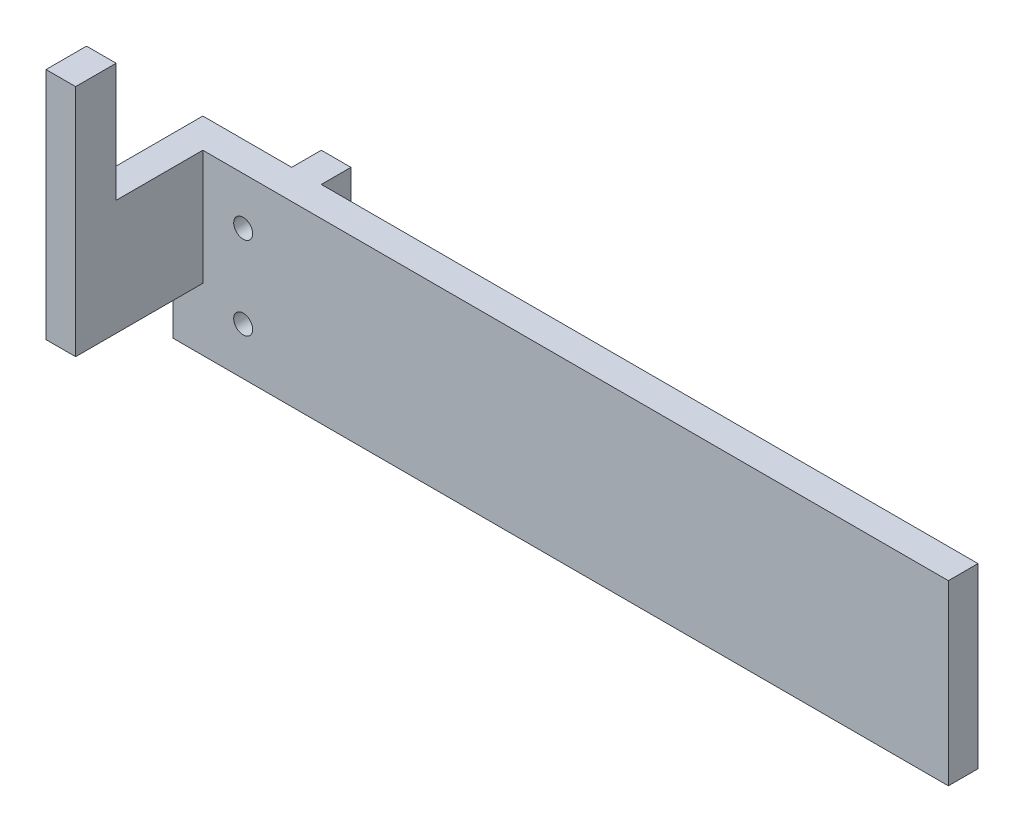
ISO-10303-21;
HEADER;
FILE_DESCRIPTION(('STEP AP214'),'2;1');
FILE_NAME('part.step','',(''),(''),'','','');
FILE_SCHEMA(('AUTOMOTIVE_DESIGN { 1 0 10303 214 1 1 1 1 }'));
ENDSEC;
DATA;
#1=APPLICATION_CONTEXT('core data for automotive mechanical design processes');
#2=APPLICATION_PROTOCOL_DEFINITION('international standard','automotive_design',2000,#1);
#3=PRODUCT_CONTEXT('',#1,'mechanical');
#4=PRODUCT('Part','Part','',(#3));
#5=PRODUCT_RELATED_PRODUCT_CATEGORY('part','',(#4));
#6=PRODUCT_DEFINITION_FORMATION('','',#4);
#7=PRODUCT_DEFINITION_CONTEXT('part definition',#1,'design');
#8=PRODUCT_DEFINITION('design','',#6,#7);
#9=PRODUCT_DEFINITION_SHAPE('','',#8);
#10=(LENGTH_UNIT() NAMED_UNIT(*) SI_UNIT(.MILLI.,.METRE.));
#11=(NAMED_UNIT(*) PLANE_ANGLE_UNIT() SI_UNIT($,.RADIAN.));
#12=(NAMED_UNIT(*) SI_UNIT($,.STERADIAN.) SOLID_ANGLE_UNIT());
#13=UNCERTAINTY_MEASURE_WITH_UNIT(LENGTH_MEASURE(1.E-05),#10,'distance_accuracy_value','');
#14=(GEOMETRIC_REPRESENTATION_CONTEXT(3) GLOBAL_UNCERTAINTY_ASSIGNED_CONTEXT((#13)) GLOBAL_UNIT_ASSIGNED_CONTEXT((#10,
#11,#12)) REPRESENTATION_CONTEXT('',''));
#15=CARTESIAN_POINT('',(0.,0.,0.));
#16=DIRECTION('',(0.,0.,1.));
#17=DIRECTION('',(1.,0.,0.));
#18=AXIS2_PLACEMENT_3D('',#15,#16,#17);
#19=CARTESIAN_POINT('',(10.,-30.,5.));
#20=DIRECTION('',(0.,1.,0.));
#21=DIRECTION('',(-1.,0.,0.));
#22=AXIS2_PLACEMENT_3D('',#19,#20,#21);
#23=PLANE('',#22);
#24=DIRECTION('',(1.,0.,0.));
#25=VECTOR('',#24,1.);
#26=CARTESIAN_POINT('',(10.,-30.,5.));
#27=LINE('',#26,#25);
#28=CARTESIAN_POINT('',(-4.99999999999997,-30.0000000000004,5.));
#29=VERTEX_POINT('',#28);
#30=CARTESIAN_POINT('',(125.849702387772,-29.9999999999999,5.0000000000001));
#31=VERTEX_POINT('',#30);
#32=EDGE_CURVE('E11',#29,#31,#27,.T.);
#33=ORIENTED_EDGE('',*,*,#32,.F.);
#34=DIRECTION('',(0.,0.,-1.));
#35=VECTOR('',#34,1.);
#36=CARTESIAN_POINT('',(-4.99999999999994,-30.,56.8867286142334));
#37=LINE('',#36,#35);
#38=CARTESIAN_POINT('',(-5.,-30.,0.));
#39=VERTEX_POINT('',#38);
#40=EDGE_CURVE('E133',#29,#39,#37,.T.);
#41=ORIENTED_EDGE('',*,*,#40,.T.);
#42=DIRECTION('',(1.,0.,0.));
#43=VECTOR('',#42,1.);
#44=CARTESIAN_POINT('',(10.,-30.,0.));
#45=LINE('',#44,#43);
#46=CARTESIAN_POINT('',(10.,-30.,0.));
#47=VERTEX_POINT('',#46);
#48=EDGE_CURVE('E39',#39,#47,#45,.T.);
#49=ORIENTED_EDGE('',*,*,#48,.T.);
#50=DIRECTION('',(0.,0.,-1.));
#51=VECTOR('',#50,1.);
#52=CARTESIAN_POINT('',(10.,-30.,35.4138126514913));
#53=LINE('',#52,#51);
#54=CARTESIAN_POINT('',(10.,-30.,-5.));
#55=VERTEX_POINT('',#54);
#56=EDGE_CURVE('E189',#47,#55,#53,.T.);
#57=ORIENTED_EDGE('',*,*,#56,.T.);
#58=DIRECTION('',(1.,0.,0.));
#59=VECTOR('',#58,1.);
#60=CARTESIAN_POINT('',(10.,-30.,-5.));
#61=LINE('',#60,#59);
#62=CARTESIAN_POINT('',(15.,-30.,-5.));
#63=VERTEX_POINT('',#62);
#64=EDGE_CURVE('E179',#55,#63,#61,.T.);
#65=ORIENTED_EDGE('',*,*,#64,.T.);
#66=DIRECTION('',(0.,0.,-1.));
#67=VECTOR('',#66,1.);
#68=CARTESIAN_POINT('',(15.,-30.,35.4138126514913));
#69=LINE('',#68,#67);
#70=CARTESIAN_POINT('',(15.,-30.,1.66533453693773E-13));
#71=VERTEX_POINT('',#70);
#72=EDGE_CURVE('E191',#71,#63,#69,.T.);
#73=ORIENTED_EDGE('',*,*,#72,.F.);
#74=DIRECTION('',(1.,0.,0.));
#75=VECTOR('',#74,1.);
#76=CARTESIAN_POINT('',(-15.4138126514911,-30.,1.97196981360208E-13));
#77=LINE('',#76,#75);
#78=CARTESIAN_POINT('',(125.849702387772,-30.,0.));
#79=VERTEX_POINT('',#78);
#80=EDGE_CURVE('E174',#71,#79,#77,.T.);
#81=ORIENTED_EDGE('',*,*,#80,.T.);
#82=DIRECTION('',(0.,0.,-1.));
#83=VECTOR('',#82,1.);
#84=CARTESIAN_POINT('',(125.849702387772,-29.9999999999999,5.00000000000001));
#85=LINE('',#84,#83);
#86=EDGE_CURVE('E136',#31,#79,#85,.T.);
#87=ORIENTED_EDGE('',*,*,#86,.F.);
#88=EDGE_LOOP('',(#33,#41,#49,#57,#65,#73,#81,#87));
#89=FACE_BOUND('',#88,.T.);
#90=ADVANCED_FACE('F35',(#89),#23,.F.);
#91=CARTESIAN_POINT('',(0.,-30.,56.8867286142334));
#92=DIRECTION('',(1.,0.,0.));
#93=DIRECTION('',(0.,0.,-1.));
#94=AXIS2_PLACEMENT_3D('',#91,#92,#93);
#95=PLANE('',#94);
#96=DIRECTION('',(0.,-1.,0.));
#97=VECTOR('',#96,1.);
#98=CARTESIAN_POINT('',(0.,-30.0000000000003,26.4729159627424));
#99=LINE('',#98,#97);
#100=CARTESIAN_POINT('',(0.,20.0348101575419,26.4729159627421));
#101=VERTEX_POINT('',#100);
#102=CARTESIAN_POINT('',(0.,-19.45597939679,26.4729159627424));
#103=VERTEX_POINT('',#102);
#104=EDGE_CURVE('E152',#101,#103,#99,.T.);
#105=ORIENTED_EDGE('',*,*,#104,.T.);
#106=DIRECTION('',(0.,0.,1.));
#107=VECTOR('',#106,1.);
#108=CARTESIAN_POINT('',(0.,-19.45597939679,26.4729159627424));
#109=LINE('',#108,#107);
#110=CARTESIAN_POINT('',(0.,-19.45597939679,5.));
#111=VERTEX_POINT('',#110);
#112=EDGE_CURVE('E410',#111,#103,#109,.T.);
#113=ORIENTED_EDGE('',*,*,#112,.F.);
#114=DIRECTION('',(0.,-1.,0.));
#115=VECTOR('',#114,1.);
#116=CARTESIAN_POINT('',(0.,0.,5.));
#117=LINE('',#116,#115);
#118=CARTESIAN_POINT('',(0.,0.,5.00000000000001));
#119=VERTEX_POINT('',#118);
#120=EDGE_CURVE('E44',#119,#111,#117,.T.);
#121=ORIENTED_EDGE('',*,*,#120,.F.);
#122=DIRECTION('',(0.,0.,-1.));
#123=VECTOR('',#122,1.);
#124=CARTESIAN_POINT('',(0.,0.,56.8867286142334));
#125=LINE('',#124,#123);
#126=CARTESIAN_POINT('',(0.,0.,19.6342265327139));
#127=VERTEX_POINT('',#126);
#128=EDGE_CURVE('E157',#127,#119,#125,.T.);
#129=ORIENTED_EDGE('',*,*,#128,.F.);
#130=DIRECTION('',(0.,-1.,0.));
#131=VECTOR('',#130,1.);
#132=CARTESIAN_POINT('',(0.,28.50639047767,19.6342265327138));
#133=LINE('',#132,#131);
#134=CARTESIAN_POINT('',(0.,20.0348101575419,19.6342265327138));
#135=VERTEX_POINT('',#134);
#136=EDGE_CURVE('E429',#135,#127,#133,.T.);
#137=ORIENTED_EDGE('',*,*,#136,.F.);
#138=DIRECTION('',(0.,0.,1.));
#139=VECTOR('',#138,1.);
#140=CARTESIAN_POINT('',(0.,20.0348101575419,26.4729159627421));
#141=LINE('',#140,#139);
#142=EDGE_CURVE('E415',#135,#101,#141,.T.);
#143=ORIENTED_EDGE('',*,*,#142,.T.);
#144=EDGE_LOOP('',(#105,#113,#121,#129,#137,#143));
#145=FACE_BOUND('',#144,.T.);
#146=ADVANCED_FACE('F250',(#145),#95,.T.);
#147=CARTESIAN_POINT('',(7085.70409558259,-5534.5527787772,26.4729159628043));
#148=DIRECTION('',(0.,0.,1.));
#149=DIRECTION('',(-1.,-1.06410404851943E-12,0.));
#150=AXIS2_PLACEMENT_3D('',#147,#148,#149);
#151=PLANE('',#150);
#152=DIRECTION('',(0.,1.,0.));
#153=VECTOR('',#152,1.);
#154=CARTESIAN_POINT('',(-4.99999999999997,-30.0000000000003,26.4729159627424));
#155=LINE('',#154,#153);
#156=CARTESIAN_POINT('',(-4.99999999999997,-19.45597939679,26.4729159627423));
#157=VERTEX_POINT('',#156);
#158=CARTESIAN_POINT('',(-4.99999999999999,20.0348101575419,26.4729159627421));
#159=VERTEX_POINT('',#158);
#160=EDGE_CURVE('E435',#157,#159,#155,.T.);
#161=ORIENTED_EDGE('',*,*,#160,.F.);
#162=DIRECTION('',(-1.,0.,0.));
#163=VECTOR('',#162,1.);
#164=CARTESIAN_POINT('',(-5.,-19.45597939679,26.4729159627424));
#165=LINE('',#164,#163);
#166=EDGE_CURVE('E52',#103,#157,#165,.T.);
#167=ORIENTED_EDGE('',*,*,#166,.F.);
#168=ORIENTED_EDGE('',*,*,#104,.F.);
#169=DIRECTION('',(-1.,0.,0.));
#170=VECTOR('',#169,1.);
#171=CARTESIAN_POINT('',(-4.99999999999998,20.0348101575419,26.4729159627421));
#172=LINE('',#171,#170);
#173=EDGE_CURVE('E418',#101,#159,#172,.T.);
#174=ORIENTED_EDGE('',*,*,#173,.T.);
#175=EDGE_LOOP('',(#161,#167,#168,#174));
#176=FACE_BOUND('',#175,.T.);
#177=ADVANCED_FACE('F255',(#176),#151,.T.);
#178=CARTESIAN_POINT('',(-4.99999999999994,-30.,56.8867286142334));
#179=DIRECTION('',(-1.,0.,0.));
#180=DIRECTION('',(0.,0.,1.));
#181=AXIS2_PLACEMENT_3D('',#178,#179,#180);
#182=PLANE('',#181);
#183=ORIENTED_EDGE('',*,*,#40,.F.);
#184=DIRECTION('',(0.,1.,0.));
#185=VECTOR('',#184,1.);
#186=CARTESIAN_POINT('',(-4.99999999999997,-30.0000000000004,5.));
#187=LINE('',#186,#185);
#188=CARTESIAN_POINT('',(-5.,-19.45597939679,5.));
#189=VERTEX_POINT('',#188);
#190=EDGE_CURVE('E141',#29,#189,#187,.T.);
#191=ORIENTED_EDGE('',*,*,#190,.T.);
#192=DIRECTION('',(0.,0.,-1.));
#193=VECTOR('',#192,1.);
#194=CARTESIAN_POINT('',(-5.,-19.45597939679,26.4729159627424));
#195=LINE('',#194,#193);
#196=EDGE_CURVE('E406',#157,#189,#195,.T.);
#197=ORIENTED_EDGE('',*,*,#196,.F.);
#198=ORIENTED_EDGE('',*,*,#160,.T.);
#199=DIRECTION('',(0.,0.,-1.));
#200=VECTOR('',#199,1.);
#201=CARTESIAN_POINT('',(-4.99999999999998,20.0348101575419,26.4729159627421));
#202=LINE('',#201,#200);
#203=CARTESIAN_POINT('',(-4.99999999999999,20.0348101575419,19.6342265327138));
#204=VERTEX_POINT('',#203);
#205=EDGE_CURVE('E422',#159,#204,#202,.T.);
#206=ORIENTED_EDGE('',*,*,#205,.T.);
#207=DIRECTION('',(0.,-1.,0.));
#208=VECTOR('',#207,1.);
#209=CARTESIAN_POINT('',(-4.99999999999999,28.50639047767,19.6342265327138));
#210=LINE('',#209,#208);
#211=CARTESIAN_POINT('',(-4.99999999999997,0.,19.6342265327138));
#212=VERTEX_POINT('',#211);
#213=EDGE_CURVE('E426',#204,#212,#210,.T.);
#214=ORIENTED_EDGE('',*,*,#213,.T.);
#215=DIRECTION('',(0.,0.,-1.));
#216=VECTOR('',#215,1.);
#217=CARTESIAN_POINT('',(-4.99999999999994,0.,56.8867286142334));
#218=LINE('',#217,#216);
#219=CARTESIAN_POINT('',(-5.,0.,0.));
#220=VERTEX_POINT('',#219);
#221=EDGE_CURVE('E160',#212,#220,#218,.T.);
#222=ORIENTED_EDGE('',*,*,#221,.T.);
#223=DIRECTION('',(0.,1.,0.));
#224=VECTOR('',#223,1.);
#225=CARTESIAN_POINT('',(-5.,-30.,0.));
#226=LINE('',#225,#224);
#227=EDGE_CURVE('E150',#39,#220,#226,.T.);
#228=ORIENTED_EDGE('',*,*,#227,.F.);
#229=EDGE_LOOP('',(#183,#191,#197,#198,#206,#214,#222,#228));
#230=FACE_BOUND('',#229,.T.);
#231=ADVANCED_FACE('F148',(#230),#182,.T.);
#232=CARTESIAN_POINT('',(10.,0.,5.));
#233=DIRECTION('',(0.,-1.,0.));
#234=DIRECTION('',(1.,0.,0.));
#235=AXIS2_PLACEMENT_3D('',#232,#233,#234);
#236=PLANE('',#235);
#237=DIRECTION('',(-1.,0.,0.));
#238=VECTOR('',#237,1.);
#239=CARTESIAN_POINT('',(-4.99999999999997,0.,19.6342265327138));
#240=LINE('',#239,#238);
#241=EDGE_CURVE('E60',#127,#212,#240,.T.);
#242=ORIENTED_EDGE('',*,*,#241,.F.);
#243=ORIENTED_EDGE('',*,*,#128,.T.);
#244=DIRECTION('',(-1.,0.,0.));
#245=VECTOR('',#244,1.);
#246=CARTESIAN_POINT('',(10.,0.,5.));
#247=LINE('',#246,#245);
#248=CARTESIAN_POINT('',(125.849702387772,1.03295845249957E-13,5.0000000000001));
#249=VERTEX_POINT('',#248);
#250=EDGE_CURVE('E209',#249,#119,#247,.T.);
#251=ORIENTED_EDGE('',*,*,#250,.F.);
#252=DIRECTION('',(0.,0.,1.));
#253=VECTOR('',#252,1.);
#254=CARTESIAN_POINT('',(125.849702387772,1.03295845249957E-13,5.00000000000001));
#255=LINE('',#254,#253);
#256=CARTESIAN_POINT('',(125.849702387772,1.02828204910526E-13,0.));
#257=VERTEX_POINT('',#256);
#258=EDGE_CURVE('E166',#257,#249,#255,.T.);
#259=ORIENTED_EDGE('',*,*,#258,.F.);
#260=DIRECTION('',(1.,0.,0.));
#261=VECTOR('',#260,1.);
#262=CARTESIAN_POINT('',(-15.4138126514911,0.,1.98065079721063E-13));
#263=LINE('',#262,#261);
#264=CARTESIAN_POINT('',(15.,0.,1.64298964648741E-13));
#265=VERTEX_POINT('',#264);
#266=EDGE_CURVE('E169',#265,#257,#263,.T.);
#267=ORIENTED_EDGE('',*,*,#266,.F.);
#268=DIRECTION('',(0.,0.,-1.));
#269=VECTOR('',#268,1.);
#270=CARTESIAN_POINT('',(15.,0.,35.4138126514913));
#271=LINE('',#270,#269);
#272=CARTESIAN_POINT('',(15.,0.,-5.));
#273=VERTEX_POINT('',#272);
#274=EDGE_CURVE('E193',#265,#273,#271,.T.);
#275=ORIENTED_EDGE('',*,*,#274,.T.);
#276=DIRECTION('',(-1.,0.,0.));
#277=VECTOR('',#276,1.);
#278=CARTESIAN_POINT('',(10.,0.,-5.));
#279=LINE('',#278,#277);
#280=CARTESIAN_POINT('',(10.,0.,-5.));
#281=VERTEX_POINT('',#280);
#282=EDGE_CURVE('E185',#273,#281,#279,.T.);
#283=ORIENTED_EDGE('',*,*,#282,.T.);
#284=DIRECTION('',(0.,0.,-1.));
#285=VECTOR('',#284,1.);
#286=CARTESIAN_POINT('',(10.,0.,35.4138126514913));
#287=LINE('',#286,#285);
#288=CARTESIAN_POINT('',(10.,0.,0.));
#289=VERTEX_POINT('',#288);
#290=EDGE_CURVE('E188',#289,#281,#287,.T.);
#291=ORIENTED_EDGE('',*,*,#290,.F.);
#292=DIRECTION('',(-1.,0.,0.));
#293=VECTOR('',#292,1.);
#294=CARTESIAN_POINT('',(10.,0.,0.));
#295=LINE('',#294,#293);
#296=EDGE_CURVE('E214',#289,#220,#295,.T.);
#297=ORIENTED_EDGE('',*,*,#296,.T.);
#298=ORIENTED_EDGE('',*,*,#221,.F.);
#299=EDGE_LOOP('',(#242,#243,#251,#259,#267,#275,#283,#291,#297,#298));
#300=FACE_BOUND('',#299,.T.);
#301=ADVANCED_FACE('F37',(#300),#236,.F.);
#302=CARTESIAN_POINT('',(0.,0.,5.));
#303=DIRECTION('',(0.,0.,-1.));
#304=DIRECTION('',(-1.,0.,0.));
#305=AXIS2_PLACEMENT_3D('',#302,#303,#304);
#306=PLANE('',#305);
#307=CARTESIAN_POINT('',(6.81031037360218,-8.00000000000006,5.));
#308=DIRECTION('',(0.,0.,-1.));
#309=DIRECTION('',(-1.,0.,0.));
#310=AXIS2_PLACEMENT_3D('',#307,#308,#309);
#311=CIRCLE('',#310,1.6);
#312=CARTESIAN_POINT('',(5.21031037360218,-8.00000000000006,5.));
#313=VERTEX_POINT('',#312);
#314=EDGE_CURVE('E205',#313,#313,#311,.T.);
#315=ORIENTED_EDGE('',*,*,#314,.T.);
#316=EDGE_LOOP('',(#315));
#317=FACE_BOUND('',#316,.T.);
#318=CARTESIAN_POINT('',(6.81031037360219,-22.0000000000001,5.));
#319=DIRECTION('',(0.,0.,-1.));
#320=DIRECTION('',(-1.,0.,0.));
#321=AXIS2_PLACEMENT_3D('',#318,#319,#320);
#322=CIRCLE('',#321,1.6);
#323=CARTESIAN_POINT('',(5.21031037360218,-22.0000000000001,5.));
#324=VERTEX_POINT('',#323);
#325=EDGE_CURVE('E200',#324,#324,#322,.T.);
#326=ORIENTED_EDGE('',*,*,#325,.T.);
#327=EDGE_LOOP('',(#326));
#328=FACE_BOUND('',#327,.T.);
#329=ORIENTED_EDGE('',*,*,#32,.T.);
#330=DIRECTION('',(0.,-1.,0.));
#331=VECTOR('',#330,1.);
#332=CARTESIAN_POINT('',(125.849702387772,-29.9999999999999,5.00000000000004));
#333=LINE('',#332,#331);
#334=EDGE_CURVE('E164',#249,#31,#333,.T.);
#335=ORIENTED_EDGE('',*,*,#334,.F.);
#336=ORIENTED_EDGE('',*,*,#250,.T.);
#337=ORIENTED_EDGE('',*,*,#120,.T.);
#338=DIRECTION('',(1.,0.,0.));
#339=VECTOR('',#338,1.);
#340=CARTESIAN_POINT('',(-5.,-19.45597939679,5.));
#341=LINE('',#340,#339);
#342=EDGE_CURVE('E144',#189,#111,#341,.T.);
#343=ORIENTED_EDGE('',*,*,#342,.F.);
#344=ORIENTED_EDGE('',*,*,#190,.F.);
#345=EDGE_LOOP('',(#329,#335,#336,#337,#343,#344));
#346=FACE_BOUND('',#345,.T.);
#347=ADVANCED_FACE('F142',(#317,#328,#346),#306,.F.);
#348=CARTESIAN_POINT('',(0.,0.,0.));
#349=DIRECTION('',(0.,0.,-1.));
#350=DIRECTION('',(-1.,0.,0.));
#351=AXIS2_PLACEMENT_3D('',#348,#349,#350);
#352=PLANE('',#351);
#353=CARTESIAN_POINT('',(6.81031037360218,-8.00000000000006,0.));
#354=DIRECTION('',(0.,0.,-1.));
#355=DIRECTION('',(-1.,0.,0.));
#356=AXIS2_PLACEMENT_3D('',#353,#354,#355);
#357=CIRCLE('',#356,1.6);
#358=CARTESIAN_POINT('',(5.21031037360218,-8.00000000000006,0.));
#359=VERTEX_POINT('',#358);
#360=EDGE_CURVE('E197',#359,#359,#357,.T.);
#361=ORIENTED_EDGE('',*,*,#360,.F.);
#362=EDGE_LOOP('',(#361));
#363=FACE_BOUND('',#362,.T.);
#364=CARTESIAN_POINT('',(6.81031037360219,-22.0000000000001,0.));
#365=DIRECTION('',(0.,0.,-1.));
#366=DIRECTION('',(-1.,0.,0.));
#367=AXIS2_PLACEMENT_3D('',#364,#365,#366);
#368=CIRCLE('',#367,1.6);
#369=CARTESIAN_POINT('',(5.21031037360218,-22.0000000000001,0.));
#370=VERTEX_POINT('',#369);
#371=EDGE_CURVE('E195',#370,#370,#368,.T.);
#372=ORIENTED_EDGE('',*,*,#371,.F.);
#373=EDGE_LOOP('',(#372));
#374=FACE_BOUND('',#373,.T.);
#375=DIRECTION('',(0.,1.,0.));
#376=VECTOR('',#375,1.);
#377=CARTESIAN_POINT('',(10.,0.,0.));
#378=LINE('',#377,#376);
#379=EDGE_CURVE('E208',#47,#289,#378,.T.);
#380=ORIENTED_EDGE('',*,*,#379,.F.);
#381=ORIENTED_EDGE('',*,*,#48,.F.);
#382=ORIENTED_EDGE('',*,*,#227,.T.);
#383=ORIENTED_EDGE('',*,*,#296,.F.);
#384=EDGE_LOOP('',(#380,#381,#382,#383));
#385=FACE_BOUND('',#384,.T.);
#386=ADVANCED_FACE('F221',(#363,#374,#385),#352,.T.);
#387=CARTESIAN_POINT('',(6.81031037360219,-22.0000000000001,43.));
#388=DIRECTION('',(0.,0.,-1.));
#389=DIRECTION('',(-1.,0.,0.));
#390=AXIS2_PLACEMENT_3D('',#387,#388,#389);
#391=CYLINDRICAL_SURFACE('',#390,1.6);
#392=ORIENTED_EDGE('',*,*,#371,.T.);
#393=EDGE_LOOP('',(#392));
#394=FACE_BOUND('',#393,.T.);
#395=ORIENTED_EDGE('',*,*,#325,.F.);
#396=EDGE_LOOP('',(#395));
#397=FACE_BOUND('',#396,.T.);
#398=ADVANCED_FACE('F261',(#394,#397),#391,.F.);
#399=CARTESIAN_POINT('',(6.81031037360218,-8.00000000000006,43.));
#400=DIRECTION('',(0.,0.,-1.));
#401=DIRECTION('',(-1.,0.,0.));
#402=AXIS2_PLACEMENT_3D('',#399,#400,#401);
#403=CYLINDRICAL_SURFACE('',#402,1.6);
#404=ORIENTED_EDGE('',*,*,#360,.T.);
#405=EDGE_LOOP('',(#404));
#406=FACE_BOUND('',#405,.T.);
#407=ORIENTED_EDGE('',*,*,#314,.F.);
#408=EDGE_LOOP('',(#407));
#409=FACE_BOUND('',#408,.T.);
#410=ADVANCED_FACE('F268',(#406,#409),#403,.F.);
#411=CARTESIAN_POINT('',(10.,0.,35.4138126514913));
#412=DIRECTION('',(1.,0.,0.));
#413=DIRECTION('',(0.,0.,-1.));
#414=AXIS2_PLACEMENT_3D('',#411,#412,#413);
#415=PLANE('',#414);
#416=ORIENTED_EDGE('',*,*,#56,.F.);
#417=ORIENTED_EDGE('',*,*,#379,.T.);
#418=ORIENTED_EDGE('',*,*,#290,.T.);
#419=DIRECTION('',(0.,-1.,0.));
#420=VECTOR('',#419,1.);
#421=CARTESIAN_POINT('',(10.,0.,-5.));
#422=LINE('',#421,#420);
#423=EDGE_CURVE('E173',#281,#55,#422,.T.);
#424=ORIENTED_EDGE('',*,*,#423,.T.);
#425=EDGE_LOOP('',(#416,#417,#418,#424));
#426=FACE_BOUND('',#425,.T.);
#427=ADVANCED_FACE('F223',(#426),#415,.F.);
#428=CARTESIAN_POINT('',(15.,0.,35.4138126514913));
#429=DIRECTION('',(-1.,0.,0.));
#430=DIRECTION('',(0.,-1.,0.));
#431=AXIS2_PLACEMENT_3D('',#428,#429,#430);
#432=PLANE('',#431);
#433=ORIENTED_EDGE('',*,*,#274,.F.);
#434=DIRECTION('',(0.,-1.,0.));
#435=VECTOR('',#434,1.);
#436=CARTESIAN_POINT('',(15.,-30.,1.63430866287887E-13));
#437=LINE('',#436,#435);
#438=EDGE_CURVE('E170',#265,#71,#437,.T.);
#439=ORIENTED_EDGE('',*,*,#438,.T.);
#440=ORIENTED_EDGE('',*,*,#72,.T.);
#441=DIRECTION('',(0.,1.,0.));
#442=VECTOR('',#441,1.);
#443=CARTESIAN_POINT('',(15.,0.,-5.));
#444=LINE('',#443,#442);
#445=EDGE_CURVE('E182',#63,#273,#444,.T.);
#446=ORIENTED_EDGE('',*,*,#445,.T.);
#447=EDGE_LOOP('',(#433,#439,#440,#446));
#448=FACE_BOUND('',#447,.T.);
#449=ADVANCED_FACE('F233',(#448),#432,.F.);
#450=CARTESIAN_POINT('',(0.,0.,-5.));
#451=DIRECTION('',(0.,0.,1.));
#452=DIRECTION('',(1.,0.,0.));
#453=AXIS2_PLACEMENT_3D('',#450,#451,#452);
#454=PLANE('',#453);
#455=ORIENTED_EDGE('',*,*,#423,.F.);
#456=ORIENTED_EDGE('',*,*,#282,.F.);
#457=ORIENTED_EDGE('',*,*,#445,.F.);
#458=ORIENTED_EDGE('',*,*,#64,.F.);
#459=EDGE_LOOP('',(#455,#456,#457,#458));
#460=FACE_BOUND('',#459,.T.);
#461=ADVANCED_FACE('F227',(#460),#454,.F.);
#462=CARTESIAN_POINT('',(-15.4138126514911,-30.,1.97196981360208E-13));
#463=DIRECTION('',(0.,0.,1.));
#464=DIRECTION('',(1.,0.,0.));
#465=AXIS2_PLACEMENT_3D('',#462,#463,#464);
#466=PLANE('',#465);
#467=ORIENTED_EDGE('',*,*,#438,.F.);
#468=ORIENTED_EDGE('',*,*,#266,.T.);
#469=DIRECTION('',(0.,1.,0.));
#470=VECTOR('',#469,1.);
#471=CARTESIAN_POINT('',(125.849702387772,-29.9999999999999,0.));
#472=LINE('',#471,#470);
#473=EDGE_CURVE('E151',#79,#257,#472,.T.);
#474=ORIENTED_EDGE('',*,*,#473,.F.);
#475=ORIENTED_EDGE('',*,*,#80,.F.);
#476=EDGE_LOOP('',(#467,#468,#474,#475));
#477=FACE_BOUND('',#476,.T.);
#478=ADVANCED_FACE('F239',(#477),#466,.F.);
#479=CARTESIAN_POINT('',(125.849702387772,-30.0000000000001,6.00000000000017));
#480=DIRECTION('',(-1.,0.,0.));
#481=DIRECTION('',(0.,-1.,0.));
#482=AXIS2_PLACEMENT_3D('',#479,#480,#481);
#483=PLANE('',#482);
#484=ORIENTED_EDGE('',*,*,#334,.T.);
#485=ORIENTED_EDGE('',*,*,#86,.T.);
#486=ORIENTED_EDGE('',*,*,#473,.T.);
#487=ORIENTED_EDGE('',*,*,#258,.T.);
#488=EDGE_LOOP('',(#484,#485,#486,#487));
#489=FACE_BOUND('',#488,.T.);
#490=ADVANCED_FACE('F238',(#489),#483,.F.);
#491=CARTESIAN_POINT('',(-4.99999999999999,28.50639047767,19.6342265327138));
#492=DIRECTION('',(0.,0.,1.));
#493=DIRECTION('',(1.,0.,0.));
#494=AXIS2_PLACEMENT_3D('',#491,#492,#493);
#495=PLANE('',#494);
#496=ORIENTED_EDGE('',*,*,#213,.F.);
#497=DIRECTION('',(1.,0.,0.));
#498=VECTOR('',#497,1.);
#499=CARTESIAN_POINT('',(-4.99999999999998,20.0348101575419,19.6342265327138));
#500=LINE('',#499,#498);
#501=EDGE_CURVE('E419',#204,#135,#500,.T.);
#502=ORIENTED_EDGE('',*,*,#501,.T.);
#503=ORIENTED_EDGE('',*,*,#136,.T.);
#504=ORIENTED_EDGE('',*,*,#241,.T.);
#505=EDGE_LOOP('',(#496,#502,#503,#504));
#506=FACE_BOUND('',#505,.T.);
#507=ADVANCED_FACE('F246',(#506),#495,.F.);
#508=CARTESIAN_POINT('',(222.903993312766,20.0348101575421,90.3412085354732));
#509=DIRECTION('',(0.,-1.,0.));
#510=DIRECTION('',(-0.796862069813004,0.,-0.604161271262347));
#511=AXIS2_PLACEMENT_3D('',#508,#509,#510);
#512=PLANE('',#511);
#513=ORIENTED_EDGE('',*,*,#173,.F.);
#514=ORIENTED_EDGE('',*,*,#142,.F.);
#515=ORIENTED_EDGE('',*,*,#501,.F.);
#516=ORIENTED_EDGE('',*,*,#205,.F.);
#517=EDGE_LOOP('',(#513,#514,#515,#516));
#518=FACE_BOUND('',#517,.T.);
#519=ADVANCED_FACE('F352',(#518),#512,.F.);
#520=CARTESIAN_POINT('',(0.,-19.45597939679,0.));
#521=DIRECTION('',(0.,-1.,0.));
#522=DIRECTION('',(1.,0.,0.));
#523=AXIS2_PLACEMENT_3D('',#520,#521,#522);
#524=PLANE('',#523);
#525=ORIENTED_EDGE('',*,*,#196,.T.);
#526=ORIENTED_EDGE('',*,*,#342,.T.);
#527=ORIENTED_EDGE('',*,*,#112,.T.);
#528=ORIENTED_EDGE('',*,*,#166,.T.);
#529=EDGE_LOOP('',(#525,#526,#527,#528));
#530=FACE_BOUND('',#529,.T.);
#531=ADVANCED_FACE('F361',(#530),#524,.T.);
#532=CLOSED_SHELL('',(#90,#146,#177,#231,#301,#347,#386,#398,#410,#427,#449,#461,#478,#490,#507,
#519,#531));
#533=MANIFOLD_SOLID_BREP('B2',#532);
#534=ADVANCED_BREP_SHAPE_REPRESENTATION('',(#18,#533),#14);
#535=SHAPE_DEFINITION_REPRESENTATION(#9,#534);
ENDSEC;
END-ISO-10303-21;
